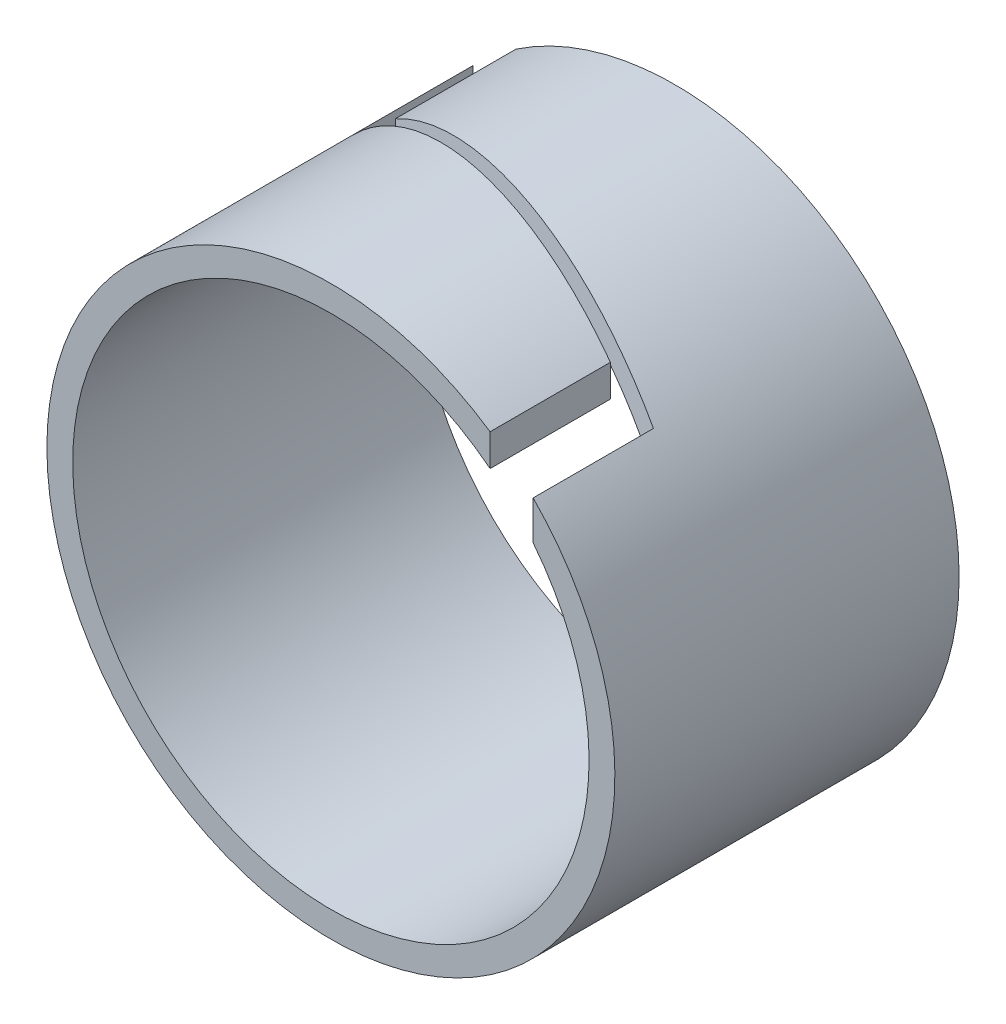
ISO-10303-21;
HEADER;
FILE_DESCRIPTION(('STEP AP214'),'2;1');
FILE_NAME('part.step','',(''),(''),'','','');
FILE_SCHEMA(('AUTOMOTIVE_DESIGN { 1 0 10303 214 1 1 1 1 }'));
ENDSEC;
DATA;
#1=APPLICATION_CONTEXT('core data for automotive mechanical design processes');
#2=APPLICATION_PROTOCOL_DEFINITION('international standard','automotive_design',2000,#1);
#3=PRODUCT_CONTEXT('',#1,'mechanical');
#4=PRODUCT('Part','Part','',(#3));
#5=PRODUCT_RELATED_PRODUCT_CATEGORY('part','',(#4));
#6=PRODUCT_DEFINITION_FORMATION('','',#4);
#7=PRODUCT_DEFINITION_CONTEXT('part definition',#1,'design');
#8=PRODUCT_DEFINITION('design','',#6,#7);
#9=PRODUCT_DEFINITION_SHAPE('','',#8);
#10=(LENGTH_UNIT() NAMED_UNIT(*) SI_UNIT(.MILLI.,.METRE.));
#11=(NAMED_UNIT(*) PLANE_ANGLE_UNIT() SI_UNIT($,.RADIAN.));
#12=(NAMED_UNIT(*) SI_UNIT($,.STERADIAN.) SOLID_ANGLE_UNIT());
#13=UNCERTAINTY_MEASURE_WITH_UNIT(LENGTH_MEASURE(1.E-05),#10,'distance_accuracy_value','');
#14=(GEOMETRIC_REPRESENTATION_CONTEXT(3) GLOBAL_UNCERTAINTY_ASSIGNED_CONTEXT((#13)) GLOBAL_UNIT_ASSIGNED_CONTEXT((#10,
#11,#12)) REPRESENTATION_CONTEXT('',''));
#15=CARTESIAN_POINT('',(0.,0.,0.));
#16=DIRECTION('',(0.,0.,1.));
#17=DIRECTION('',(1.,0.,0.));
#18=AXIS2_PLACEMENT_3D('',#15,#16,#17);
#19=CARTESIAN_POINT('',(0.,0.,4.));
#20=DIRECTION('',(0.,0.,1.));
#21=DIRECTION('',(1.,0.,0.));
#22=AXIS2_PLACEMENT_3D('',#19,#20,#21);
#23=PLANE('',#22);
#24=DIRECTION('',(0.,1.,0.));
#25=VECTOR('',#24,1.);
#26=CARTESIAN_POINT('',(2.35,-1.7,4.));
#27=LINE('',#26,#25);
#28=CARTESIAN_POINT('',(2.35,1.86480561989715,4.));
#29=VERTEX_POINT('',#28);
#30=CARTESIAN_POINT('',(2.35,2.31678656764062,4.));
#31=VERTEX_POINT('',#30);
#32=EDGE_CURVE('E170',#29,#31,#27,.T.);
#33=ORIENTED_EDGE('',*,*,#32,.F.);
#34=CARTESIAN_POINT('',(0.,0.,4.));
#35=DIRECTION('',(0.,0.,1.));
#36=DIRECTION('',(1.,0.,0.));
#37=AXIS2_PLACEMENT_3D('',#34,#35,#36);
#38=CIRCLE('',#37,3.);
#39=CARTESIAN_POINT('',(1.85,2.36167313572391,4.));
#40=VERTEX_POINT('',#39);
#41=EDGE_CURVE('E135',#40,#29,#38,.T.);
#42=ORIENTED_EDGE('',*,*,#41,.F.);
#43=DIRECTION('',(0.,1.,0.));
#44=VECTOR('',#43,1.);
#45=CARTESIAN_POINT('',(1.85,-1.7,4.));
#46=LINE('',#45,#44);
#47=CARTESIAN_POINT('',(1.85,2.73267268438794,4.));
#48=VERTEX_POINT('',#47);
#49=EDGE_CURVE('E176',#40,#48,#46,.T.);
#50=ORIENTED_EDGE('',*,*,#49,.T.);
#51=CARTESIAN_POINT('',(0.,0.,4.));
#52=DIRECTION('',(0.,0.,1.));
#53=DIRECTION('',(1.,0.,0.));
#54=AXIS2_PLACEMENT_3D('',#51,#52,#53);
#55=CIRCLE('',#54,3.3);
#56=EDGE_CURVE('E145',#48,#31,#55,.T.);
#57=ORIENTED_EDGE('',*,*,#56,.T.);
#58=EDGE_LOOP('',(#33,#42,#50,#57));
#59=FACE_BOUND('',#58,.T.);
#60=ADVANCED_FACE('F45',(#59),#23,.T.);
#61=CARTESIAN_POINT('',(0.,0.,0.));
#62=DIRECTION('',(0.,0.,1.));
#63=DIRECTION('',(1.,0.,0.));
#64=AXIS2_PLACEMENT_3D('',#61,#62,#63);
#65=PLANE('',#64);
#66=CARTESIAN_POINT('',(0.,0.,0.));
#67=DIRECTION('',(0.,0.,1.));
#68=DIRECTION('',(1.,0.,0.));
#69=AXIS2_PLACEMENT_3D('',#66,#67,#68);
#70=CIRCLE('',#69,3.);
#71=CARTESIAN_POINT('',(-2.35,1.86480561989715,0.));
#72=VERTEX_POINT('',#71);
#73=CARTESIAN_POINT('',(-1.85,2.36167313572391,0.));
#74=VERTEX_POINT('',#73);
#75=EDGE_CURVE('E130',#72,#74,#70,.T.);
#76=ORIENTED_EDGE('',*,*,#75,.T.);
#77=DIRECTION('',(0.,1.,0.));
#78=VECTOR('',#77,1.);
#79=CARTESIAN_POINT('',(-1.85,-1.7,0.));
#80=LINE('',#79,#78);
#81=CARTESIAN_POINT('',(-1.85,2.73267268438794,0.));
#82=VERTEX_POINT('',#81);
#83=EDGE_CURVE('E111',#74,#82,#80,.T.);
#84=ORIENTED_EDGE('',*,*,#83,.T.);
#85=CARTESIAN_POINT('',(0.,0.,0.));
#86=DIRECTION('',(0.,0.,1.));
#87=DIRECTION('',(1.,0.,0.));
#88=AXIS2_PLACEMENT_3D('',#85,#86,#87);
#89=CIRCLE('',#88,3.3);
#90=CARTESIAN_POINT('',(-2.35,2.31678656764062,0.));
#91=VERTEX_POINT('',#90);
#92=EDGE_CURVE('E140',#91,#82,#89,.T.);
#93=ORIENTED_EDGE('',*,*,#92,.F.);
#94=DIRECTION('',(0.,1.,0.));
#95=VECTOR('',#94,1.);
#96=CARTESIAN_POINT('',(-2.35,-1.7,0.));
#97=LINE('',#96,#95);
#98=EDGE_CURVE('E123',#72,#91,#97,.T.);
#99=ORIENTED_EDGE('',*,*,#98,.F.);
#100=EDGE_LOOP('',(#76,#84,#93,#99));
#101=FACE_BOUND('',#100,.T.);
#102=ADVANCED_FACE('F133',(#101),#65,.F.);
#103=CARTESIAN_POINT('',(0.,0.,4.));
#104=DIRECTION('',(0.,0.,-1.));
#105=DIRECTION('',(-1.,0.,0.));
#106=AXIS2_PLACEMENT_3D('',#103,#104,#105);
#107=CYLINDRICAL_SURFACE('',#106,3.3);
#108=ORIENTED_EDGE('',*,*,#92,.T.);
#109=DIRECTION('',(0.,0.,-1.));
#110=VECTOR('',#109,1.);
#111=CARTESIAN_POINT('',(-1.85,2.73267268438794,4.));
#112=LINE('',#111,#110);
#113=CARTESIAN_POINT('',(-1.85,2.73267268438794,1.40000000000002));
#114=VERTEX_POINT('',#113);
#115=EDGE_CURVE('E117',#82,#114,#112,.F.);
#116=ORIENTED_EDGE('',*,*,#115,.T.);
#117=CARTESIAN_POINT('',(0.,0.,1.92934667117364));
#118=DIRECTION('',(0.275093583130178,0.,-0.961417453825652));
#119=DIRECTION('',(-0.961417453825652,0.,-0.275093583130178));
#120=AXIS2_PLACEMENT_3D('',#117,#118,#119);
#121=ELLIPSE('',#120,3.43243196477109,3.3);
#122=CARTESIAN_POINT('',(2.35,2.31678656764062,2.60176001023202));
#123=VERTEX_POINT('',#122);
#124=EDGE_CURVE('E142',#114,#123,#121,.T.);
#125=ORIENTED_EDGE('',*,*,#124,.T.);
#126=DIRECTION('',(0.,0.,-1.));
#127=VECTOR('',#126,1.);
#128=CARTESIAN_POINT('',(2.35,2.31678656764062,4.));
#129=LINE('',#128,#127);
#130=EDGE_CURVE('E203',#123,#31,#129,.F.);
#131=ORIENTED_EDGE('',*,*,#130,.T.);
#132=ORIENTED_EDGE('',*,*,#56,.F.);
#133=DIRECTION('',(0.,0.,-1.));
#134=VECTOR('',#133,1.);
#135=CARTESIAN_POINT('',(1.85,2.73267268438794,4.));
#136=LINE('',#135,#134);
#137=CARTESIAN_POINT('',(1.85,2.73267268438794,2.60176001023201));
#138=VERTEX_POINT('',#137);
#139=EDGE_CURVE('E199',#48,#138,#136,.T.);
#140=ORIENTED_EDGE('',*,*,#139,.T.);
#141=CARTESIAN_POINT('',(0.,0.,2.07241333905839));
#142=DIRECTION('',(-0.275093583130178,0.,0.961417453825652));
#143=DIRECTION('',(-0.961417453825652,0.,-0.275093583130178));
#144=AXIS2_PLACEMENT_3D('',#141,#142,#143);
#145=ELLIPSE('',#144,3.43243196477109,3.3);
#146=CARTESIAN_POINT('',(-2.35,2.31678656764062,1.4));
#147=VERTEX_POINT('',#146);
#148=EDGE_CURVE('E196',#138,#147,#145,.T.);
#149=ORIENTED_EDGE('',*,*,#148,.T.);
#150=DIRECTION('',(0.,0.,-1.));
#151=VECTOR('',#150,1.);
#152=CARTESIAN_POINT('',(-2.35,2.31678656764062,4.));
#153=LINE('',#152,#151);
#154=EDGE_CURVE('E192',#147,#91,#153,.T.);
#155=ORIENTED_EDGE('',*,*,#154,.T.);
#156=EDGE_LOOP('',(#108,#116,#125,#131,#132,#140,#149,#155));
#157=FACE_BOUND('',#156,.T.);
#158=ADVANCED_FACE('F47',(#157),#107,.T.);
#159=CARTESIAN_POINT('',(0.,0.,4.));
#160=DIRECTION('',(0.,0.,-1.));
#161=DIRECTION('',(-1.,0.,0.));
#162=AXIS2_PLACEMENT_3D('',#159,#160,#161);
#163=CYLINDRICAL_SURFACE('',#162,3.);
#164=DIRECTION('',(0.,0.,-1.));
#165=VECTOR('',#164,1.);
#166=CARTESIAN_POINT('',(-1.85,2.36167313572391,4.));
#167=LINE('',#166,#165);
#168=CARTESIAN_POINT('',(-1.85,2.36167313572391,1.40000000000002));
#169=VERTEX_POINT('',#168);
#170=EDGE_CURVE('E11',#74,#169,#167,.F.);
#171=ORIENTED_EDGE('',*,*,#170,.F.);
#172=ORIENTED_EDGE('',*,*,#75,.F.);
#173=DIRECTION('',(0.,0.,-1.));
#174=VECTOR('',#173,1.);
#175=CARTESIAN_POINT('',(-2.35,1.86480561989715,4.));
#176=LINE('',#175,#174);
#177=CARTESIAN_POINT('',(-2.35,1.86480561989715,1.4));
#178=VERTEX_POINT('',#177);
#179=EDGE_CURVE('E149',#178,#72,#176,.T.);
#180=ORIENTED_EDGE('',*,*,#179,.F.);
#181=CARTESIAN_POINT('',(0.,0.,2.07241333905839));
#182=DIRECTION('',(-0.275093583130178,0.,0.961417453825652));
#183=DIRECTION('',(-0.961417453825652,0.,-0.275093583130178));
#184=AXIS2_PLACEMENT_3D('',#181,#182,#183);
#185=ELLIPSE('',#184,3.12039269524644,3.);
#186=CARTESIAN_POINT('',(1.85,2.36167313572391,2.60176001023201));
#187=VERTEX_POINT('',#186);
#188=EDGE_CURVE('E154',#187,#178,#185,.T.);
#189=ORIENTED_EDGE('',*,*,#188,.F.);
#190=DIRECTION('',(0.,0.,-1.));
#191=VECTOR('',#190,1.);
#192=CARTESIAN_POINT('',(1.85,2.36167313572391,4.));
#193=LINE('',#192,#191);
#194=EDGE_CURVE('E157',#40,#187,#193,.T.);
#195=ORIENTED_EDGE('',*,*,#194,.F.);
#196=ORIENTED_EDGE('',*,*,#41,.T.);
#197=DIRECTION('',(0.,0.,-1.));
#198=VECTOR('',#197,1.);
#199=CARTESIAN_POINT('',(2.35,1.86480561989715,4.));
#200=LINE('',#199,#198);
#201=CARTESIAN_POINT('',(2.35,1.86480561989715,2.60176001023202));
#202=VERTEX_POINT('',#201);
#203=EDGE_CURVE('E160',#202,#29,#200,.F.);
#204=ORIENTED_EDGE('',*,*,#203,.F.);
#205=CARTESIAN_POINT('',(0.,0.,1.92934667117364));
#206=DIRECTION('',(0.275093583130178,0.,-0.961417453825652));
#207=DIRECTION('',(-0.961417453825652,0.,-0.275093583130178));
#208=AXIS2_PLACEMENT_3D('',#205,#206,#207);
#209=ELLIPSE('',#208,3.12039269524644,3.);
#210=EDGE_CURVE('E54',#169,#202,#209,.T.);
#211=ORIENTED_EDGE('',*,*,#210,.F.);
#212=EDGE_LOOP('',(#171,#172,#180,#189,#195,#196,#204,#211));
#213=FACE_BOUND('',#212,.T.);
#214=ADVANCED_FACE('F128',(#213),#163,.F.);
#215=CARTESIAN_POINT('',(-2.35,-1.7,1.4));
#216=DIRECTION('',(-1.,0.,0.));
#217=DIRECTION('',(0.,0.,1.));
#218=AXIS2_PLACEMENT_3D('',#215,#216,#217);
#219=PLANE('',#218);
#220=DIRECTION('',(0.,1.,0.));
#221=VECTOR('',#220,1.);
#222=CARTESIAN_POINT('',(-2.35,-1.7,1.4));
#223=LINE('',#222,#221);
#224=EDGE_CURVE('E69',#178,#147,#223,.T.);
#225=ORIENTED_EDGE('',*,*,#224,.F.);
#226=ORIENTED_EDGE('',*,*,#179,.T.);
#227=ORIENTED_EDGE('',*,*,#98,.T.);
#228=ORIENTED_EDGE('',*,*,#154,.F.);
#229=EDGE_LOOP('',(#225,#226,#227,#228));
#230=FACE_BOUND('',#229,.T.);
#231=ADVANCED_FACE('F209',(#230),#219,.F.);
#232=CARTESIAN_POINT('',(-2.35,-1.7,1.4));
#233=DIRECTION('',(-0.275093583130178,0.,0.961417453825652));
#234=DIRECTION('',(0.961417453825652,0.,0.275093583130178));
#235=AXIS2_PLACEMENT_3D('',#232,#233,#234);
#236=PLANE('',#235);
#237=DIRECTION('',(0.,1.,0.));
#238=VECTOR('',#237,1.);
#239=CARTESIAN_POINT('',(1.85,-1.7,2.60176001023201));
#240=LINE('',#239,#238);
#241=EDGE_CURVE('E181',#187,#138,#240,.T.);
#242=ORIENTED_EDGE('',*,*,#241,.F.);
#243=ORIENTED_EDGE('',*,*,#188,.T.);
#244=ORIENTED_EDGE('',*,*,#224,.T.);
#245=ORIENTED_EDGE('',*,*,#148,.F.);
#246=EDGE_LOOP('',(#242,#243,#244,#245));
#247=FACE_BOUND('',#246,.T.);
#248=ADVANCED_FACE('F212',(#247),#236,.F.);
#249=CARTESIAN_POINT('',(1.85,-1.7,4.));
#250=DIRECTION('',(-1.,0.,0.));
#251=DIRECTION('',(0.,0.,1.));
#252=AXIS2_PLACEMENT_3D('',#249,#250,#251);
#253=PLANE('',#252);
#254=ORIENTED_EDGE('',*,*,#49,.F.);
#255=ORIENTED_EDGE('',*,*,#194,.T.);
#256=ORIENTED_EDGE('',*,*,#241,.T.);
#257=ORIENTED_EDGE('',*,*,#139,.F.);
#258=EDGE_LOOP('',(#254,#255,#256,#257));
#259=FACE_BOUND('',#258,.T.);
#260=ADVANCED_FACE('F215',(#259),#253,.F.);
#261=CARTESIAN_POINT('',(-1.85,-1.7,0.));
#262=DIRECTION('',(1.,0.,0.));
#263=DIRECTION('',(0.,0.,-1.));
#264=AXIS2_PLACEMENT_3D('',#261,#262,#263);
#265=PLANE('',#264);
#266=ORIENTED_EDGE('',*,*,#83,.F.);
#267=ORIENTED_EDGE('',*,*,#170,.T.);
#268=DIRECTION('',(0.,1.,0.));
#269=VECTOR('',#268,1.);
#270=CARTESIAN_POINT('',(-1.85,-1.7,1.40000000000002));
#271=LINE('',#270,#269);
#272=EDGE_CURVE('E165',#169,#114,#271,.T.);
#273=ORIENTED_EDGE('',*,*,#272,.T.);
#274=ORIENTED_EDGE('',*,*,#115,.F.);
#275=EDGE_LOOP('',(#266,#267,#273,#274));
#276=FACE_BOUND('',#275,.T.);
#277=ADVANCED_FACE('F113',(#276),#265,.F.);
#278=CARTESIAN_POINT('',(2.35,-1.7,2.60176001023202));
#279=DIRECTION('',(0.275093583130178,0.,-0.961417453825652));
#280=DIRECTION('',(-0.961417453825652,0.,-0.275093583130178));
#281=AXIS2_PLACEMENT_3D('',#278,#279,#280);
#282=PLANE('',#281);
#283=ORIENTED_EDGE('',*,*,#272,.F.);
#284=ORIENTED_EDGE('',*,*,#210,.T.);
#285=DIRECTION('',(0.,1.,0.));
#286=VECTOR('',#285,1.);
#287=CARTESIAN_POINT('',(2.35,-1.7,2.60176001023202));
#288=LINE('',#287,#286);
#289=EDGE_CURVE('E61',#202,#123,#288,.T.);
#290=ORIENTED_EDGE('',*,*,#289,.T.);
#291=ORIENTED_EDGE('',*,*,#124,.F.);
#292=EDGE_LOOP('',(#283,#284,#290,#291));
#293=FACE_BOUND('',#292,.T.);
#294=ADVANCED_FACE('F164',(#293),#282,.F.);
#295=CARTESIAN_POINT('',(2.35,-1.7,4.));
#296=DIRECTION('',(1.,0.,0.));
#297=DIRECTION('',(0.,0.,-1.));
#298=AXIS2_PLACEMENT_3D('',#295,#296,#297);
#299=PLANE('',#298);
#300=ORIENTED_EDGE('',*,*,#289,.F.);
#301=ORIENTED_EDGE('',*,*,#203,.T.);
#302=ORIENTED_EDGE('',*,*,#32,.T.);
#303=ORIENTED_EDGE('',*,*,#130,.F.);
#304=EDGE_LOOP('',(#300,#301,#302,#303));
#305=FACE_BOUND('',#304,.T.);
#306=ADVANCED_FACE('F169',(#305),#299,.F.);
#307=CLOSED_SHELL('',(#60,#102,#158,#214,#231,#248,#260,#277,#294,#306));
#308=MANIFOLD_SOLID_BREP('B2',#307);
#309=ADVANCED_BREP_SHAPE_REPRESENTATION('',(#18,#308),#14);
#310=SHAPE_DEFINITION_REPRESENTATION(#9,#309);
ENDSEC;
END-ISO-10303-21;
